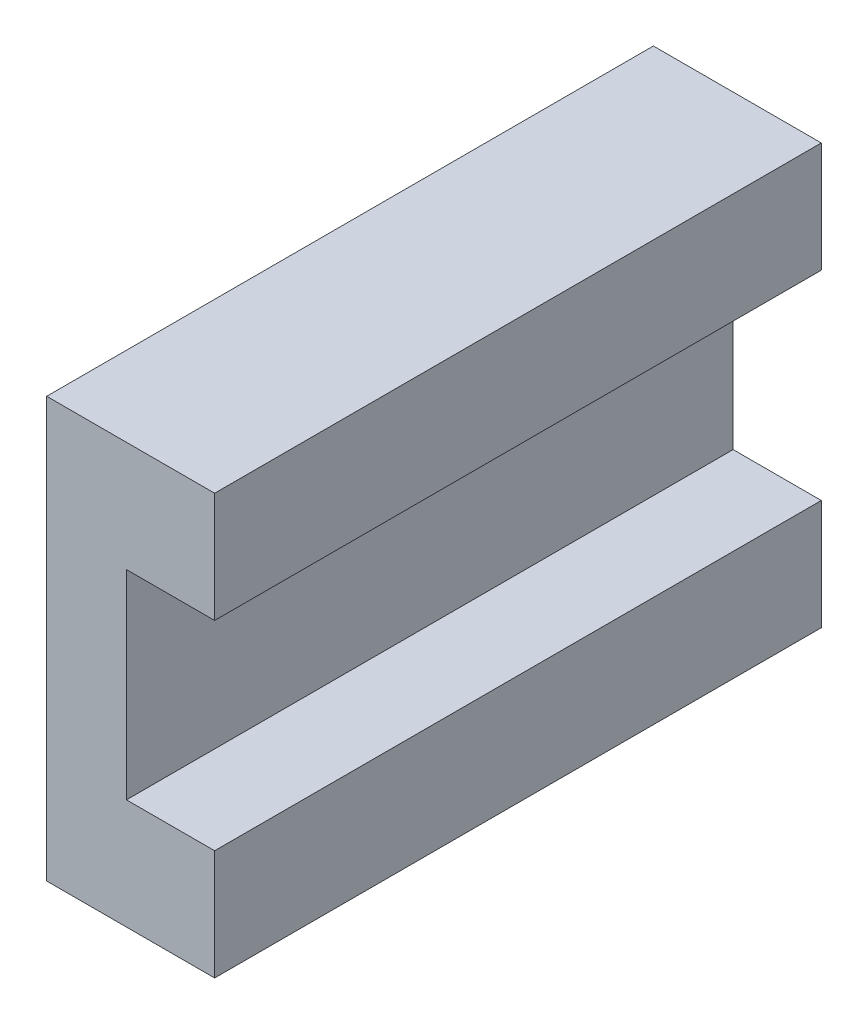
ISO-10303-21;
HEADER;
FILE_DESCRIPTION(('STEP AP214'),'2;1');
FILE_NAME('part.step','',(''),(''),'','','');
FILE_SCHEMA(('AUTOMOTIVE_DESIGN { 1 0 10303 214 1 1 1 1 }'));
ENDSEC;
DATA;
#1=APPLICATION_CONTEXT('core data for automotive mechanical design processes');
#2=APPLICATION_PROTOCOL_DEFINITION('international standard','automotive_design',2000,#1);
#3=PRODUCT_CONTEXT('',#1,'mechanical');
#4=PRODUCT('Part','Part','',(#3));
#5=PRODUCT_RELATED_PRODUCT_CATEGORY('part','',(#4));
#6=PRODUCT_DEFINITION_FORMATION('','',#4);
#7=PRODUCT_DEFINITION_CONTEXT('part definition',#1,'design');
#8=PRODUCT_DEFINITION('design','',#6,#7);
#9=PRODUCT_DEFINITION_SHAPE('','',#8);
#10=(LENGTH_UNIT() NAMED_UNIT(*) SI_UNIT(.MILLI.,.METRE.));
#11=(NAMED_UNIT(*) PLANE_ANGLE_UNIT() SI_UNIT($,.RADIAN.));
#12=(NAMED_UNIT(*) SI_UNIT($,.STERADIAN.) SOLID_ANGLE_UNIT());
#13=UNCERTAINTY_MEASURE_WITH_UNIT(LENGTH_MEASURE(1.E-05),#10,'distance_accuracy_value','');
#14=(GEOMETRIC_REPRESENTATION_CONTEXT(3) GLOBAL_UNCERTAINTY_ASSIGNED_CONTEXT((#13)) GLOBAL_UNIT_ASSIGNED_CONTEXT((#10,
#11,#12)) REPRESENTATION_CONTEXT('',''));
#15=CARTESIAN_POINT('',(0.,0.,0.));
#16=DIRECTION('',(0.,0.,1.));
#17=DIRECTION('',(1.,0.,0.));
#18=AXIS2_PLACEMENT_3D('',#15,#16,#17);
#19=CARTESIAN_POINT('',(-3.45,0.,19.45));
#20=DIRECTION('',(1.,0.,0.));
#21=DIRECTION('',(0.,1.,0.));
#22=AXIS2_PLACEMENT_3D('',#19,#20,#21);
#23=PLANE('',#22);
#24=DIRECTION('',(0.,-1.,0.));
#25=VECTOR('',#24,1.);
#26=CARTESIAN_POINT('',(-3.45,0.,-9.45));
#27=LINE('',#26,#25);
#28=CARTESIAN_POINT('',(-3.45,4.75,-9.45));
#29=VERTEX_POINT('',#28);
#30=CARTESIAN_POINT('',(-3.45,-4.75,-9.45));
#31=VERTEX_POINT('',#30);
#32=EDGE_CURVE('E172',#29,#31,#27,.T.);
#33=ORIENTED_EDGE('',*,*,#32,.F.);
#34=DIRECTION('',(0.,0.,-1.));
#35=VECTOR('',#34,1.);
#36=CARTESIAN_POINT('',(-3.45,4.75,19.45));
#37=LINE('',#36,#35);
#38=CARTESIAN_POINT('',(-3.45,4.75,19.45));
#39=VERTEX_POINT('',#38);
#40=EDGE_CURVE('E11',#39,#29,#37,.T.);
#41=ORIENTED_EDGE('',*,*,#40,.F.);
#42=DIRECTION('',(0.,-1.,0.));
#43=VECTOR('',#42,1.);
#44=CARTESIAN_POINT('',(-3.45,0.,19.45));
#45=LINE('',#44,#43);
#46=CARTESIAN_POINT('',(-3.45,-4.75,19.45));
#47=VERTEX_POINT('',#46);
#48=EDGE_CURVE('E160',#39,#47,#45,.T.);
#49=ORIENTED_EDGE('',*,*,#48,.T.);
#50=DIRECTION('',(0.,0.,-1.));
#51=VECTOR('',#50,1.);
#52=CARTESIAN_POINT('',(-3.45,-4.75,19.45));
#53=LINE('',#52,#51);
#54=EDGE_CURVE('E98',#47,#31,#53,.T.);
#55=ORIENTED_EDGE('',*,*,#54,.T.);
#56=EDGE_LOOP('',(#33,#41,#49,#55));
#57=FACE_BOUND('',#56,.T.);
#58=ADVANCED_FACE('F40',(#57),#23,.T.);
#59=CARTESIAN_POINT('',(0.,4.75,19.45));
#60=DIRECTION('',(0.,-1.,0.));
#61=DIRECTION('',(1.,0.,0.));
#62=AXIS2_PLACEMENT_3D('',#59,#60,#61);
#63=PLANE('',#62);
#64=DIRECTION('',(-1.,0.,0.));
#65=VECTOR('',#64,1.);
#66=CARTESIAN_POINT('',(0.,4.75,-9.45));
#67=LINE('',#66,#65);
#68=CARTESIAN_POINT('',(0.749999999999999,4.75,-9.45));
#69=VERTEX_POINT('',#68);
#70=EDGE_CURVE('E250',#69,#29,#67,.T.);
#71=ORIENTED_EDGE('',*,*,#70,.F.);
#72=DIRECTION('',(0.,0.,-1.));
#73=VECTOR('',#72,1.);
#74=CARTESIAN_POINT('',(0.749999999999999,4.75,19.45));
#75=LINE('',#74,#73);
#76=CARTESIAN_POINT('',(0.749999999999999,4.75,19.45));
#77=VERTEX_POINT('',#76);
#78=EDGE_CURVE('E49',#77,#69,#75,.T.);
#79=ORIENTED_EDGE('',*,*,#78,.F.);
#80=DIRECTION('',(-1.,0.,0.));
#81=VECTOR('',#80,1.);
#82=CARTESIAN_POINT('',(0.,4.75,19.45));
#83=LINE('',#82,#81);
#84=EDGE_CURVE('E153',#77,#39,#83,.T.);
#85=ORIENTED_EDGE('',*,*,#84,.T.);
#86=ORIENTED_EDGE('',*,*,#40,.T.);
#87=EDGE_LOOP('',(#71,#79,#85,#86));
#88=FACE_BOUND('',#87,.T.);
#89=ADVANCED_FACE('F251',(#88),#63,.T.);
#90=CARTESIAN_POINT('',(0.749999999999999,0.,19.45));
#91=DIRECTION('',(1.,0.,0.));
#92=DIRECTION('',(0.,0.,-1.));
#93=AXIS2_PLACEMENT_3D('',#90,#91,#92);
#94=PLANE('',#93);
#95=DIRECTION('',(0.,-1.,0.));
#96=VECTOR('',#95,1.);
#97=CARTESIAN_POINT('',(0.749999999999999,0.,-9.45));
#98=LINE('',#97,#96);
#99=CARTESIAN_POINT('',(0.749999999999999,10.,-9.45));
#100=VERTEX_POINT('',#99);
#101=EDGE_CURVE('E231',#100,#69,#98,.T.);
#102=ORIENTED_EDGE('',*,*,#101,.F.);
#103=DIRECTION('',(0.,0.,-1.));
#104=VECTOR('',#103,1.);
#105=CARTESIAN_POINT('',(0.749999999999999,10.,19.45));
#106=LINE('',#105,#104);
#107=CARTESIAN_POINT('',(0.749999999999999,10.,19.45));
#108=VERTEX_POINT('',#107);
#109=EDGE_CURVE('E243',#108,#100,#106,.T.);
#110=ORIENTED_EDGE('',*,*,#109,.F.);
#111=DIRECTION('',(0.,-1.,0.));
#112=VECTOR('',#111,1.);
#113=CARTESIAN_POINT('',(0.749999999999999,0.,19.45));
#114=LINE('',#113,#112);
#115=EDGE_CURVE('E145',#108,#77,#114,.T.);
#116=ORIENTED_EDGE('',*,*,#115,.T.);
#117=ORIENTED_EDGE('',*,*,#78,.T.);
#118=EDGE_LOOP('',(#102,#110,#116,#117));
#119=FACE_BOUND('',#118,.T.);
#120=ADVANCED_FACE('F247',(#119),#94,.T.);
#121=CARTESIAN_POINT('',(0.,10.,19.45));
#122=DIRECTION('',(0.,-1.,0.));
#123=DIRECTION('',(0.,0.,-1.));
#124=AXIS2_PLACEMENT_3D('',#121,#122,#123);
#125=PLANE('',#124);
#126=DIRECTION('',(-1.,0.,0.));
#127=VECTOR('',#126,1.);
#128=CARTESIAN_POINT('',(0.,10.,-9.45));
#129=LINE('',#128,#127);
#130=CARTESIAN_POINT('',(-7.25,10.,-9.45));
#131=VERTEX_POINT('',#130);
#132=EDGE_CURVE('E224',#100,#131,#129,.T.);
#133=ORIENTED_EDGE('',*,*,#132,.T.);
#134=DIRECTION('',(0.,0.,-1.));
#135=VECTOR('',#134,1.);
#136=CARTESIAN_POINT('',(-7.25,10.,19.45));
#137=LINE('',#136,#135);
#138=CARTESIAN_POINT('',(-7.25,10.,19.45));
#139=VERTEX_POINT('',#138);
#140=EDGE_CURVE('E220',#139,#131,#137,.T.);
#141=ORIENTED_EDGE('',*,*,#140,.F.);
#142=DIRECTION('',(-1.,0.,0.));
#143=VECTOR('',#142,1.);
#144=CARTESIAN_POINT('',(0.,10.,19.45));
#145=LINE('',#144,#143);
#146=EDGE_CURVE('E152',#108,#139,#145,.T.);
#147=ORIENTED_EDGE('',*,*,#146,.F.);
#148=ORIENTED_EDGE('',*,*,#109,.T.);
#149=EDGE_LOOP('',(#133,#141,#147,#148));
#150=FACE_BOUND('',#149,.T.);
#151=ADVANCED_FACE('F207',(#150),#125,.F.);
#152=CARTESIAN_POINT('',(-7.25,0.,19.45));
#153=DIRECTION('',(1.,0.,0.));
#154=DIRECTION('',(0.,0.,-1.));
#155=AXIS2_PLACEMENT_3D('',#152,#153,#154);
#156=PLANE('',#155);
#157=CARTESIAN_POINT('',(-7.25,7.5,0.));
#158=DIRECTION('',(-1.,0.,0.));
#159=DIRECTION('',(0.,0.,1.));
#160=AXIS2_PLACEMENT_3D('',#157,#158,#159);
#161=CIRCLE('',#160,1.24999999999999);
#162=CARTESIAN_POINT('',(-7.25,7.5,1.24999999999999));
#163=VERTEX_POINT('',#162);
#164=EDGE_CURVE('E196',#163,#163,#161,.T.);
#165=ORIENTED_EDGE('',*,*,#164,.F.);
#166=EDGE_LOOP('',(#165));
#167=FACE_BOUND('',#166,.T.);
#168=CARTESIAN_POINT('',(-7.25,-7.5,10.));
#169=DIRECTION('',(-1.,0.,0.));
#170=DIRECTION('',(0.,0.,1.));
#171=AXIS2_PLACEMENT_3D('',#168,#169,#170);
#172=CIRCLE('',#171,1.24999999999999);
#173=CARTESIAN_POINT('',(-7.25,-7.5,11.25));
#174=VERTEX_POINT('',#173);
#175=EDGE_CURVE('E188',#174,#174,#172,.T.);
#176=ORIENTED_EDGE('',*,*,#175,.F.);
#177=EDGE_LOOP('',(#176));
#178=FACE_BOUND('',#177,.T.);
#179=CARTESIAN_POINT('',(-7.25,-7.5,0.));
#180=DIRECTION('',(-1.,0.,0.));
#181=DIRECTION('',(0.,0.,1.));
#182=AXIS2_PLACEMENT_3D('',#179,#180,#181);
#183=CIRCLE('',#182,1.24999999999999);
#184=CARTESIAN_POINT('',(-7.25,-7.5,1.24999999999999));
#185=VERTEX_POINT('',#184);
#186=EDGE_CURVE('E181',#185,#185,#183,.T.);
#187=ORIENTED_EDGE('',*,*,#186,.F.);
#188=EDGE_LOOP('',(#187));
#189=FACE_BOUND('',#188,.T.);
#190=CARTESIAN_POINT('',(-7.25,7.5,10.));
#191=DIRECTION('',(-1.,0.,0.));
#192=DIRECTION('',(0.,0.,1.));
#193=AXIS2_PLACEMENT_3D('',#190,#191,#192);
#194=CIRCLE('',#193,1.24999999999999);
#195=CARTESIAN_POINT('',(-7.25,7.5,11.25));
#196=VERTEX_POINT('',#195);
#197=EDGE_CURVE('E173',#196,#196,#194,.T.);
#198=ORIENTED_EDGE('',*,*,#197,.F.);
#199=EDGE_LOOP('',(#198));
#200=FACE_BOUND('',#199,.T.);
#201=DIRECTION('',(0.,-1.,0.));
#202=VECTOR('',#201,1.);
#203=CARTESIAN_POINT('',(-7.25,0.,-9.45));
#204=LINE('',#203,#202);
#205=CARTESIAN_POINT('',(-7.25,-10.,-9.45));
#206=VERTEX_POINT('',#205);
#207=EDGE_CURVE('E218',#131,#206,#204,.T.);
#208=ORIENTED_EDGE('',*,*,#207,.T.);
#209=DIRECTION('',(0.,0.,-1.));
#210=VECTOR('',#209,1.);
#211=CARTESIAN_POINT('',(-7.25,-10.,19.45));
#212=LINE('',#211,#210);
#213=CARTESIAN_POINT('',(-7.25,-10.,19.45));
#214=VERTEX_POINT('',#213);
#215=EDGE_CURVE('E134',#214,#206,#212,.T.);
#216=ORIENTED_EDGE('',*,*,#215,.F.);
#217=DIRECTION('',(0.,-1.,0.));
#218=VECTOR('',#217,1.);
#219=CARTESIAN_POINT('',(-7.25,0.,19.45));
#220=LINE('',#219,#218);
#221=EDGE_CURVE('E139',#139,#214,#220,.T.);
#222=ORIENTED_EDGE('',*,*,#221,.F.);
#223=ORIENTED_EDGE('',*,*,#140,.T.);
#224=EDGE_LOOP('',(#208,#216,#222,#223));
#225=FACE_BOUND('',#224,.T.);
#226=ADVANCED_FACE('F204',(#167,#178,#189,#200,#225),#156,.F.);
#227=CARTESIAN_POINT('',(0.,-10.,19.45));
#228=DIRECTION('',(0.,-1.,0.));
#229=DIRECTION('',(0.,0.,-1.));
#230=AXIS2_PLACEMENT_3D('',#227,#228,#229);
#231=PLANE('',#230);
#232=DIRECTION('',(-1.,0.,0.));
#233=VECTOR('',#232,1.);
#234=CARTESIAN_POINT('',(0.,-10.,-9.45));
#235=LINE('',#234,#233);
#236=CARTESIAN_POINT('',(0.749999999999999,-10.,-9.45));
#237=VERTEX_POINT('',#236);
#238=EDGE_CURVE('E128',#237,#206,#235,.T.);
#239=ORIENTED_EDGE('',*,*,#238,.F.);
#240=DIRECTION('',(0.,0.,-1.));
#241=VECTOR('',#240,1.);
#242=CARTESIAN_POINT('',(0.749999999999999,-10.,19.45));
#243=LINE('',#242,#241);
#244=CARTESIAN_POINT('',(0.749999999999999,-10.,19.45));
#245=VERTEX_POINT('',#244);
#246=EDGE_CURVE('E123',#245,#237,#243,.T.);
#247=ORIENTED_EDGE('',*,*,#246,.F.);
#248=DIRECTION('',(-1.,0.,0.));
#249=VECTOR('',#248,1.);
#250=CARTESIAN_POINT('',(0.,-10.,19.45));
#251=LINE('',#250,#249);
#252=EDGE_CURVE('E126',#245,#214,#251,.T.);
#253=ORIENTED_EDGE('',*,*,#252,.T.);
#254=ORIENTED_EDGE('',*,*,#215,.T.);
#255=EDGE_LOOP('',(#239,#247,#253,#254));
#256=FACE_BOUND('',#255,.T.);
#257=ADVANCED_FACE('F125',(#256),#231,.T.);
#258=CARTESIAN_POINT('',(0.749999999999999,-4.75,-9.45));
#259=VERTEX_POINT('',#258);
#260=EDGE_CURVE('E228',#259,#237,#98,.T.);
#261=ORIENTED_EDGE('',*,*,#260,.F.);
#262=DIRECTION('',(0.,0.,-1.));
#263=VECTOR('',#262,1.);
#264=CARTESIAN_POINT('',(0.749999999999999,-4.75,19.45));
#265=LINE('',#264,#263);
#266=CARTESIAN_POINT('',(0.749999999999999,-4.75,19.45));
#267=VERTEX_POINT('',#266);
#268=EDGE_CURVE('E91',#267,#259,#265,.T.);
#269=ORIENTED_EDGE('',*,*,#268,.F.);
#270=EDGE_CURVE('E137',#267,#245,#114,.T.);
#271=ORIENTED_EDGE('',*,*,#270,.T.);
#272=ORIENTED_EDGE('',*,*,#246,.T.);
#273=EDGE_LOOP('',(#261,#269,#271,#272));
#274=FACE_BOUND('',#273,.T.);
#275=ADVANCED_FACE('F142',(#274),#94,.T.);
#276=CARTESIAN_POINT('',(0.,-4.75,19.45));
#277=DIRECTION('',(0.,-1.,0.));
#278=DIRECTION('',(0.,0.,-1.));
#279=AXIS2_PLACEMENT_3D('',#276,#277,#278);
#280=PLANE('',#279);
#281=DIRECTION('',(-1.,0.,0.));
#282=VECTOR('',#281,1.);
#283=CARTESIAN_POINT('',(0.,-4.75,-9.45));
#284=LINE('',#283,#282);
#285=EDGE_CURVE('E165',#259,#31,#284,.T.);
#286=ORIENTED_EDGE('',*,*,#285,.T.);
#287=ORIENTED_EDGE('',*,*,#54,.F.);
#288=DIRECTION('',(-1.,0.,0.));
#289=VECTOR('',#288,1.);
#290=CARTESIAN_POINT('',(0.,-4.75,19.45));
#291=LINE('',#290,#289);
#292=EDGE_CURVE('E60',#267,#47,#291,.T.);
#293=ORIENTED_EDGE('',*,*,#292,.F.);
#294=ORIENTED_EDGE('',*,*,#268,.T.);
#295=EDGE_LOOP('',(#286,#287,#293,#294));
#296=FACE_BOUND('',#295,.T.);
#297=ADVANCED_FACE('F274',(#296),#280,.F.);
#298=CARTESIAN_POINT('',(0.,0.,19.45));
#299=DIRECTION('',(0.,0.,1.));
#300=DIRECTION('',(1.,0.,0.));
#301=AXIS2_PLACEMENT_3D('',#298,#299,#300);
#302=PLANE('',#301);
#303=ORIENTED_EDGE('',*,*,#48,.F.);
#304=ORIENTED_EDGE('',*,*,#84,.F.);
#305=ORIENTED_EDGE('',*,*,#115,.F.);
#306=ORIENTED_EDGE('',*,*,#146,.T.);
#307=ORIENTED_EDGE('',*,*,#221,.T.);
#308=ORIENTED_EDGE('',*,*,#252,.F.);
#309=ORIENTED_EDGE('',*,*,#270,.F.);
#310=ORIENTED_EDGE('',*,*,#292,.T.);
#311=EDGE_LOOP('',(#303,#304,#305,#306,#307,#308,#309,#310));
#312=FACE_BOUND('',#311,.T.);
#313=ADVANCED_FACE('F136',(#312),#302,.T.);
#314=CARTESIAN_POINT('',(0.,0.,-9.45));
#315=DIRECTION('',(0.,0.,1.));
#316=DIRECTION('',(1.,0.,0.));
#317=AXIS2_PLACEMENT_3D('',#314,#315,#316);
#318=PLANE('',#317);
#319=ORIENTED_EDGE('',*,*,#32,.T.);
#320=ORIENTED_EDGE('',*,*,#285,.F.);
#321=ORIENTED_EDGE('',*,*,#260,.T.);
#322=ORIENTED_EDGE('',*,*,#238,.T.);
#323=ORIENTED_EDGE('',*,*,#207,.F.);
#324=ORIENTED_EDGE('',*,*,#132,.F.);
#325=ORIENTED_EDGE('',*,*,#101,.T.);
#326=ORIENTED_EDGE('',*,*,#70,.T.);
#327=EDGE_LOOP('',(#319,#320,#321,#322,#323,#324,#325,#326));
#328=FACE_BOUND('',#327,.T.);
#329=ADVANCED_FACE('F227',(#328),#318,.F.);
#330=CARTESIAN_POINT('',(-4.25,7.5,10.));
#331=DIRECTION('',(-1.,0.,0.));
#332=DIRECTION('',(0.,0.,1.));
#333=AXIS2_PLACEMENT_3D('',#330,#331,#332);
#334=CONICAL_SURFACE('',#333,1.24999999999999,1.02974425867665);
#335=CARTESIAN_POINT('',(-3.49892422621556,7.5,10.));
#336=VERTEX_POINT('',#335);
#337=VERTEX_LOOP('',#336);
#338=FACE_BOUND('',#337,.T.);
#339=CARTESIAN_POINT('',(-4.25,7.5,10.));
#340=DIRECTION('',(-1.,0.,0.));
#341=DIRECTION('',(0.,0.,1.));
#342=AXIS2_PLACEMENT_3D('',#339,#340,#341);
#343=CIRCLE('',#342,1.24999999999999);
#344=CARTESIAN_POINT('',(-4.25,7.5,11.25));
#345=VERTEX_POINT('',#344);
#346=EDGE_CURVE('E168',#345,#345,#343,.T.);
#347=ORIENTED_EDGE('',*,*,#346,.T.);
#348=EDGE_LOOP('',(#347));
#349=FACE_BOUND('',#348,.T.);
#350=ADVANCED_FACE('F279',(#338,#349),#334,.F.);
#351=CARTESIAN_POINT('',(-7.25,7.5,10.));
#352=DIRECTION('',(-1.,0.,0.));
#353=DIRECTION('',(0.,0.,1.));
#354=AXIS2_PLACEMENT_3D('',#351,#352,#353);
#355=CYLINDRICAL_SURFACE('',#354,1.24999999999999);
#356=ORIENTED_EDGE('',*,*,#346,.F.);
#357=EDGE_LOOP('',(#356));
#358=FACE_BOUND('',#357,.T.);
#359=ORIENTED_EDGE('',*,*,#197,.T.);
#360=EDGE_LOOP('',(#359));
#361=FACE_BOUND('',#360,.T.);
#362=ADVANCED_FACE('F284',(#358,#361),#355,.F.);
#363=CARTESIAN_POINT('',(-4.25,-7.5,0.));
#364=DIRECTION('',(-1.,0.,0.));
#365=DIRECTION('',(0.,0.,1.));
#366=AXIS2_PLACEMENT_3D('',#363,#364,#365);
#367=CONICAL_SURFACE('',#366,1.24999999999999,1.02974425867665);
#368=CARTESIAN_POINT('',(-3.49892422621556,-7.5,0.));
#369=VERTEX_POINT('',#368);
#370=VERTEX_LOOP('',#369);
#371=FACE_BOUND('',#370,.T.);
#372=CARTESIAN_POINT('',(-4.25,-7.5,0.));
#373=DIRECTION('',(-1.,0.,0.));
#374=DIRECTION('',(0.,0.,1.));
#375=AXIS2_PLACEMENT_3D('',#372,#373,#374);
#376=CIRCLE('',#375,1.24999999999999);
#377=CARTESIAN_POINT('',(-4.25,-7.5,1.24999999999999));
#378=VERTEX_POINT('',#377);
#379=EDGE_CURVE('E177',#378,#378,#376,.T.);
#380=ORIENTED_EDGE('',*,*,#379,.T.);
#381=EDGE_LOOP('',(#380));
#382=FACE_BOUND('',#381,.T.);
#383=ADVANCED_FACE('F288',(#371,#382),#367,.F.);
#384=CARTESIAN_POINT('',(-7.25,-7.5,0.));
#385=DIRECTION('',(-1.,0.,0.));
#386=DIRECTION('',(0.,0.,1.));
#387=AXIS2_PLACEMENT_3D('',#384,#385,#386);
#388=CYLINDRICAL_SURFACE('',#387,1.24999999999999);
#389=ORIENTED_EDGE('',*,*,#379,.F.);
#390=EDGE_LOOP('',(#389));
#391=FACE_BOUND('',#390,.T.);
#392=ORIENTED_EDGE('',*,*,#186,.T.);
#393=EDGE_LOOP('',(#392));
#394=FACE_BOUND('',#393,.T.);
#395=ADVANCED_FACE('F292',(#391,#394),#388,.F.);
#396=CARTESIAN_POINT('',(-4.25,-7.5,10.));
#397=DIRECTION('',(-1.,0.,0.));
#398=DIRECTION('',(0.,0.,1.));
#399=AXIS2_PLACEMENT_3D('',#396,#397,#398);
#400=CONICAL_SURFACE('',#399,1.24999999999999,1.02974425867665);
#401=CARTESIAN_POINT('',(-3.49892422621556,-7.5,10.));
#402=VERTEX_POINT('',#401);
#403=VERTEX_LOOP('',#402);
#404=FACE_BOUND('',#403,.T.);
#405=CARTESIAN_POINT('',(-4.25,-7.5,10.));
#406=DIRECTION('',(-1.,0.,0.));
#407=DIRECTION('',(0.,0.,1.));
#408=AXIS2_PLACEMENT_3D('',#405,#406,#407);
#409=CIRCLE('',#408,1.24999999999999);
#410=CARTESIAN_POINT('',(-4.25,-7.5,11.25));
#411=VERTEX_POINT('',#410);
#412=EDGE_CURVE('E184',#411,#411,#409,.T.);
#413=ORIENTED_EDGE('',*,*,#412,.T.);
#414=EDGE_LOOP('',(#413));
#415=FACE_BOUND('',#414,.T.);
#416=ADVANCED_FACE('F296',(#404,#415),#400,.F.);
#417=CARTESIAN_POINT('',(-7.25,-7.5,10.));
#418=DIRECTION('',(-1.,0.,0.));
#419=DIRECTION('',(0.,0.,1.));
#420=AXIS2_PLACEMENT_3D('',#417,#418,#419);
#421=CYLINDRICAL_SURFACE('',#420,1.24999999999999);
#422=ORIENTED_EDGE('',*,*,#412,.F.);
#423=EDGE_LOOP('',(#422));
#424=FACE_BOUND('',#423,.T.);
#425=ORIENTED_EDGE('',*,*,#175,.T.);
#426=EDGE_LOOP('',(#425));
#427=FACE_BOUND('',#426,.T.);
#428=ADVANCED_FACE('F300',(#424,#427),#421,.F.);
#429=CARTESIAN_POINT('',(-4.25,7.5,0.));
#430=DIRECTION('',(-1.,0.,0.));
#431=DIRECTION('',(0.,0.,1.));
#432=AXIS2_PLACEMENT_3D('',#429,#430,#431);
#433=CONICAL_SURFACE('',#432,1.24999999999999,1.02974425867665);
#434=CARTESIAN_POINT('',(-3.49892422621556,7.5,0.));
#435=VERTEX_POINT('',#434);
#436=VERTEX_LOOP('',#435);
#437=FACE_BOUND('',#436,.T.);
#438=CARTESIAN_POINT('',(-4.25,7.5,0.));
#439=DIRECTION('',(-1.,0.,0.));
#440=DIRECTION('',(0.,0.,1.));
#441=AXIS2_PLACEMENT_3D('',#438,#439,#440);
#442=CIRCLE('',#441,1.24999999999999);
#443=CARTESIAN_POINT('',(-4.25,7.5,1.24999999999999));
#444=VERTEX_POINT('',#443);
#445=EDGE_CURVE('E192',#444,#444,#442,.T.);
#446=ORIENTED_EDGE('',*,*,#445,.T.);
#447=EDGE_LOOP('',(#446));
#448=FACE_BOUND('',#447,.T.);
#449=ADVANCED_FACE('F304',(#437,#448),#433,.F.);
#450=CARTESIAN_POINT('',(-7.25,7.5,0.));
#451=DIRECTION('',(-1.,0.,0.));
#452=DIRECTION('',(0.,0.,1.));
#453=AXIS2_PLACEMENT_3D('',#450,#451,#452);
#454=CYLINDRICAL_SURFACE('',#453,1.24999999999999);
#455=ORIENTED_EDGE('',*,*,#445,.F.);
#456=EDGE_LOOP('',(#455));
#457=FACE_BOUND('',#456,.T.);
#458=ORIENTED_EDGE('',*,*,#164,.T.);
#459=EDGE_LOOP('',(#458));
#460=FACE_BOUND('',#459,.T.);
#461=ADVANCED_FACE('F202',(#457,#460),#454,.F.);
#462=CLOSED_SHELL('',(#58,#89,#120,#151,#226,#257,#275,#297,#313,#329,#350,#362,#383,#395,#416,
#428,#449,#461));
#463=MANIFOLD_SOLID_BREP('B2',#462);
#464=ADVANCED_BREP_SHAPE_REPRESENTATION('',(#18,#463),#14);
#465=SHAPE_DEFINITION_REPRESENTATION(#9,#464);
ENDSEC;
END-ISO-10303-21;
